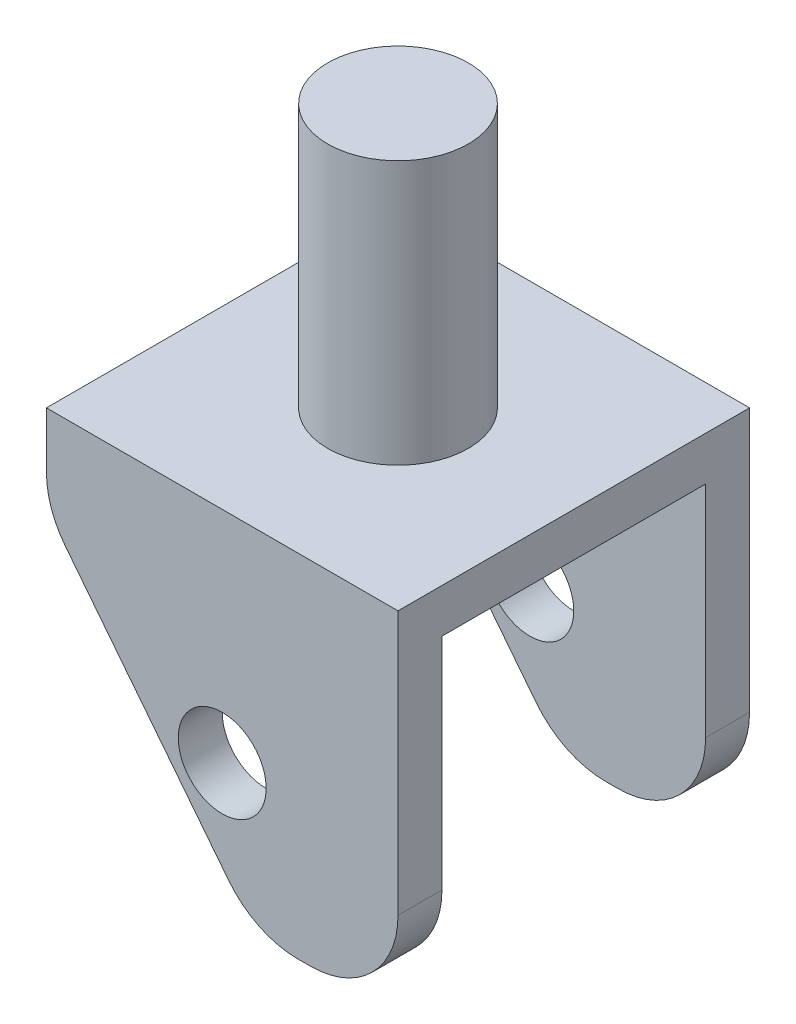
ISO-10303-21;
HEADER;
FILE_DESCRIPTION(('STEP AP214'),'2;1');
FILE_NAME('part.step','',(''),(''),'','','');
FILE_SCHEMA(('AUTOMOTIVE_DESIGN { 1 0 10303 214 1 1 1 1 }'));
ENDSEC;
DATA;
#1=APPLICATION_CONTEXT('core data for automotive mechanical design processes');
#2=APPLICATION_PROTOCOL_DEFINITION('international standard','automotive_design',2000,#1);
#3=PRODUCT_CONTEXT('',#1,'mechanical');
#4=PRODUCT('Part','Part','',(#3));
#5=PRODUCT_RELATED_PRODUCT_CATEGORY('part','',(#4));
#6=PRODUCT_DEFINITION_FORMATION('','',#4);
#7=PRODUCT_DEFINITION_CONTEXT('part definition',#1,'design');
#8=PRODUCT_DEFINITION('design','',#6,#7);
#9=PRODUCT_DEFINITION_SHAPE('','',#8);
#10=(LENGTH_UNIT() NAMED_UNIT(*) SI_UNIT(.MILLI.,.METRE.));
#11=(NAMED_UNIT(*) PLANE_ANGLE_UNIT() SI_UNIT($,.RADIAN.));
#12=(NAMED_UNIT(*) SI_UNIT($,.STERADIAN.) SOLID_ANGLE_UNIT());
#13=UNCERTAINTY_MEASURE_WITH_UNIT(LENGTH_MEASURE(1.E-05),#10,'distance_accuracy_value','');
#14=(GEOMETRIC_REPRESENTATION_CONTEXT(3) GLOBAL_UNCERTAINTY_ASSIGNED_CONTEXT((#13)) GLOBAL_UNIT_ASSIGNED_CONTEXT((#10,
#11,#12)) REPRESENTATION_CONTEXT('',''));
#15=CARTESIAN_POINT('',(0.,0.,0.));
#16=DIRECTION('',(0.,0.,1.));
#17=DIRECTION('',(1.,0.,0.));
#18=AXIS2_PLACEMENT_3D('',#15,#16,#17);
#19=CARTESIAN_POINT('',(-8.99022801302931,13.1058889009629,40.));
#20=DIRECTION('',(0.786278855083332,0.617871800658393,0.));
#21=DIRECTION('',(-0.617871800658393,0.786278855083332,0.));
#22=AXIS2_PLACEMENT_3D('',#19,#20,#21);
#23=PLANE('',#22);
#24=DIRECTION('',(0.617871800658393,-0.786278855083332,0.));
#25=VECTOR('',#24,1.);
#26=CARTESIAN_POINT('',(-8.99022801302931,13.1058889009629,40.));
#27=LINE('',#26,#25);
#28=CARTESIAN_POINT('',(-6.85301656386263,10.3861593882531,40.));
#29=VERTEX_POINT('',#28);
#30=CARTESIAN_POINT('',(11.729764492103,-13.2615419591451,40.));
#31=VERTEX_POINT('',#30);
#32=EDGE_CURVE('E216',#29,#31,#27,.T.);
#33=ORIENTED_EDGE('',*,*,#32,.F.);
#34=DIRECTION('',(0.,0.,-1.));
#35=VECTOR('',#34,1.);
#36=CARTESIAN_POINT('',(-6.85301656386263,10.3861593882531,40.));
#37=LINE('',#36,#35);
#38=CARTESIAN_POINT('',(-6.85301656386263,10.3861593882531,35.));
#39=VERTEX_POINT('',#38);
#40=EDGE_CURVE('E320',#29,#39,#37,.T.);
#41=ORIENTED_EDGE('',*,*,#40,.T.);
#42=DIRECTION('',(0.617871800658393,-0.786278855083332,0.));
#43=VECTOR('',#42,1.);
#44=CARTESIAN_POINT('',(-8.99022801302931,13.1058889009629,35.));
#45=LINE('',#44,#43);
#46=CARTESIAN_POINT('',(11.729764492103,-13.2615419591451,35.));
#47=VERTEX_POINT('',#46);
#48=EDGE_CURVE('E207',#39,#47,#45,.T.);
#49=ORIENTED_EDGE('',*,*,#48,.T.);
#50=DIRECTION('',(0.,0.,-1.));
#51=VECTOR('',#50,1.);
#52=CARTESIAN_POINT('',(11.729764492103,-13.2615419591451,40.));
#53=LINE('',#52,#51);
#54=EDGE_CURVE('E317',#47,#31,#53,.F.);
#55=ORIENTED_EDGE('',*,*,#54,.T.);
#56=EDGE_LOOP('',(#33,#41,#49,#55));
#57=FACE_BOUND('',#56,.T.);
#58=ADVANCED_FACE('F38',(#57),#23,.F.);
#59=CARTESIAN_POINT('',(14.7325953209255,-17.0828239525612,40.));
#60=DIRECTION('',(0.,1.,0.));
#61=DIRECTION('',(0.,0.,1.));
#62=AXIS2_PLACEMENT_3D('',#59,#60,#61);
#63=PLANE('',#62);
#64=DIRECTION('',(1.,0.,0.));
#65=VECTOR('',#64,1.);
#66=CARTESIAN_POINT('',(-8.99022801302931,-17.0828239525612,35.));
#67=LINE('',#66,#65);
#68=CARTESIAN_POINT('',(19.5925530429363,-17.0828239525612,35.));
#69=VERTEX_POINT('',#68);
#70=CARTESIAN_POINT('',(21.0097719869707,-17.0828239525612,35.));
#71=VERTEX_POINT('',#70);
#72=EDGE_CURVE('E182',#69,#71,#67,.T.);
#73=ORIENTED_EDGE('',*,*,#72,.T.);
#74=DIRECTION('',(0.,0.,-1.));
#75=VECTOR('',#74,1.);
#76=CARTESIAN_POINT('',(21.0097719869707,-17.0828239525612,40.));
#77=LINE('',#76,#75);
#78=CARTESIAN_POINT('',(21.0097719869707,-17.0828239525612,40.));
#79=VERTEX_POINT('',#78);
#80=EDGE_CURVE('E281',#71,#79,#77,.F.);
#81=ORIENTED_EDGE('',*,*,#80,.T.);
#82=DIRECTION('',(1.,0.,0.));
#83=VECTOR('',#82,1.);
#84=CARTESIAN_POINT('',(14.7325953209255,-17.0828239525612,40.));
#85=LINE('',#84,#83);
#86=CARTESIAN_POINT('',(19.5925530429363,-17.0828239525612,40.));
#87=VERTEX_POINT('',#86);
#88=EDGE_CURVE('E221',#87,#79,#85,.T.);
#89=ORIENTED_EDGE('',*,*,#88,.F.);
#90=DIRECTION('',(0.,0.,-1.));
#91=VECTOR('',#90,1.);
#92=CARTESIAN_POINT('',(19.5925530429363,-17.0828239525612,40.));
#93=LINE('',#92,#91);
#94=EDGE_CURVE('E277',#87,#69,#93,.T.);
#95=ORIENTED_EDGE('',*,*,#94,.T.);
#96=EDGE_LOOP('',(#73,#81,#89,#95));
#97=FACE_BOUND('',#96,.T.);
#98=ADVANCED_FACE('F413',(#97),#63,.F.);
#99=CARTESIAN_POINT('',(-8.99022801302931,22.9171760474388,40.));
#100=DIRECTION('',(1.,0.,0.));
#101=DIRECTION('',(0.,1.,0.));
#102=AXIS2_PLACEMENT_3D('',#99,#100,#101);
#103=PLANE('',#102);
#104=DIRECTION('',(0.,-1.,0.));
#105=VECTOR('',#104,1.);
#106=CARTESIAN_POINT('',(-8.99022801302931,-17.0828239525612,35.));
#107=LINE('',#106,#105);
#108=CARTESIAN_POINT('',(-8.99022801302931,17.9171760474388,35.));
#109=VERTEX_POINT('',#108);
#110=CARTESIAN_POINT('',(-8.99022801302931,16.564877394837,35.));
#111=VERTEX_POINT('',#110);
#112=EDGE_CURVE('E164',#109,#111,#107,.T.);
#113=ORIENTED_EDGE('',*,*,#112,.T.);
#114=DIRECTION('',(0.,0.,-1.));
#115=VECTOR('',#114,1.);
#116=CARTESIAN_POINT('',(-8.99022801302931,16.564877394837,40.));
#117=LINE('',#116,#115);
#118=CARTESIAN_POINT('',(-8.99022801302931,16.564877394837,40.));
#119=VERTEX_POINT('',#118);
#120=EDGE_CURVE('E326',#111,#119,#117,.F.);
#121=ORIENTED_EDGE('',*,*,#120,.T.);
#122=DIRECTION('',(0.,-1.,0.));
#123=VECTOR('',#122,1.);
#124=CARTESIAN_POINT('',(-8.99022801302931,22.9171760474388,40.));
#125=LINE('',#124,#123);
#126=CARTESIAN_POINT('',(-8.99022801302931,22.9171760474388,40.));
#127=VERTEX_POINT('',#126);
#128=EDGE_CURVE('E212',#127,#119,#125,.T.);
#129=ORIENTED_EDGE('',*,*,#128,.F.);
#130=DIRECTION('',(0.,0.,-1.));
#131=VECTOR('',#130,1.);
#132=CARTESIAN_POINT('',(-8.99022801302931,22.9171760474388,40.));
#133=LINE('',#132,#131);
#134=CARTESIAN_POINT('',(-8.99022801302931,22.9171760474388,0.));
#135=VERTEX_POINT('',#134);
#136=EDGE_CURVE('E233',#127,#135,#133,.T.);
#137=ORIENTED_EDGE('',*,*,#136,.T.);
#138=DIRECTION('',(0.,-1.,0.));
#139=VECTOR('',#138,1.);
#140=CARTESIAN_POINT('',(-8.99022801302931,22.9171760474388,0.));
#141=LINE('',#140,#139);
#142=CARTESIAN_POINT('',(-8.99022801302931,16.564877394837,0.));
#143=VERTEX_POINT('',#142);
#144=EDGE_CURVE('E211',#135,#143,#141,.T.);
#145=ORIENTED_EDGE('',*,*,#144,.T.);
#146=DIRECTION('',(0.,0.,-1.));
#147=VECTOR('',#146,1.);
#148=CARTESIAN_POINT('',(-8.99022801302931,16.564877394837,40.));
#149=LINE('',#148,#147);
#150=CARTESIAN_POINT('',(-8.99022801302931,16.564877394837,5.));
#151=VERTEX_POINT('',#150);
#152=EDGE_CURVE('E162',#143,#151,#149,.F.);
#153=ORIENTED_EDGE('',*,*,#152,.T.);
#154=DIRECTION('',(0.,1.,0.));
#155=VECTOR('',#154,1.);
#156=CARTESIAN_POINT('',(-8.99022801302931,-17.0828239525612,5.));
#157=LINE('',#156,#155);
#158=CARTESIAN_POINT('',(-8.99022801302931,17.9171760474388,5.));
#159=VERTEX_POINT('',#158);
#160=EDGE_CURVE('E154',#151,#159,#157,.T.);
#161=ORIENTED_EDGE('',*,*,#160,.T.);
#162=DIRECTION('',(0.,0.,1.));
#163=VECTOR('',#162,1.);
#164=CARTESIAN_POINT('',(-8.99022801302931,17.9171760474388,35.));
#165=LINE('',#164,#163);
#166=EDGE_CURVE('E159',#159,#109,#165,.T.);
#167=ORIENTED_EDGE('',*,*,#166,.T.);
#168=EDGE_LOOP('',(#113,#121,#129,#137,#145,#153,#161,#167));
#169=FACE_BOUND('',#168,.T.);
#170=ADVANCED_FACE('F157',(#169),#103,.F.);
#171=DIRECTION('',(-0.617871800658393,0.786278855083332,0.));
#172=VECTOR('',#171,1.);
#173=CARTESIAN_POINT('',(-8.99022801302931,13.1058889009629,5.));
#174=LINE('',#173,#172);
#175=CARTESIAN_POINT('',(11.729764492103,-13.2615419591451,5.));
#176=VERTEX_POINT('',#175);
#177=CARTESIAN_POINT('',(-6.85301656386263,10.3861593882531,5.));
#178=VERTEX_POINT('',#177);
#179=EDGE_CURVE('E201',#176,#178,#174,.T.);
#180=ORIENTED_EDGE('',*,*,#179,.T.);
#181=DIRECTION('',(0.,0.,-1.));
#182=VECTOR('',#181,1.);
#183=CARTESIAN_POINT('',(-6.85301656386263,10.3861593882531,40.));
#184=LINE('',#183,#182);
#185=CARTESIAN_POINT('',(-6.85301656386263,10.3861593882531,0.));
#186=VERTEX_POINT('',#185);
#187=EDGE_CURVE('E42',#178,#186,#184,.T.);
#188=ORIENTED_EDGE('',*,*,#187,.T.);
#189=DIRECTION('',(0.617871800658393,-0.786278855083332,0.));
#190=VECTOR('',#189,1.);
#191=CARTESIAN_POINT('',(-8.99022801302931,13.1058889009629,0.));
#192=LINE('',#191,#190);
#193=CARTESIAN_POINT('',(11.729764492103,-13.2615419591451,0.));
#194=VERTEX_POINT('',#193);
#195=EDGE_CURVE('E236',#186,#194,#192,.T.);
#196=ORIENTED_EDGE('',*,*,#195,.T.);
#197=DIRECTION('',(0.,0.,-1.));
#198=VECTOR('',#197,1.);
#199=CARTESIAN_POINT('',(11.729764492103,-13.2615419591451,40.));
#200=LINE('',#199,#198);
#201=EDGE_CURVE('E62',#194,#176,#200,.F.);
#202=ORIENTED_EDGE('',*,*,#201,.T.);
#203=EDGE_LOOP('',(#180,#188,#196,#202));
#204=FACE_BOUND('',#203,.T.);
#205=ADVANCED_FACE('F335',(#204),#23,.F.);
#206=DIRECTION('',(1.,0.,0.));
#207=VECTOR('',#206,1.);
#208=CARTESIAN_POINT('',(14.7325953209255,-17.0828239525612,0.));
#209=LINE('',#208,#207);
#210=CARTESIAN_POINT('',(19.5925530429363,-17.0828239525612,0.));
#211=VERTEX_POINT('',#210);
#212=CARTESIAN_POINT('',(21.0097719869707,-17.0828239525612,0.));
#213=VERTEX_POINT('',#212);
#214=EDGE_CURVE('E239',#211,#213,#209,.T.);
#215=ORIENTED_EDGE('',*,*,#214,.T.);
#216=DIRECTION('',(0.,0.,-1.));
#217=VECTOR('',#216,1.);
#218=CARTESIAN_POINT('',(21.0097719869707,-17.0828239525612,5.));
#219=LINE('',#218,#217);
#220=CARTESIAN_POINT('',(21.0097719869707,-17.0828239525612,5.));
#221=VERTEX_POINT('',#220);
#222=EDGE_CURVE('E306',#213,#221,#219,.F.);
#223=ORIENTED_EDGE('',*,*,#222,.T.);
#224=DIRECTION('',(1.,0.,0.));
#225=VECTOR('',#224,1.);
#226=CARTESIAN_POINT('',(-8.99022801302931,-17.0828239525612,5.));
#227=LINE('',#226,#225);
#228=CARTESIAN_POINT('',(19.5925530429363,-17.0828239525612,5.));
#229=VERTEX_POINT('',#228);
#230=EDGE_CURVE('E177',#229,#221,#227,.T.);
#231=ORIENTED_EDGE('',*,*,#230,.F.);
#232=DIRECTION('',(0.,0.,-1.));
#233=VECTOR('',#232,1.);
#234=CARTESIAN_POINT('',(19.5925530429363,-17.0828239525612,40.));
#235=LINE('',#234,#233);
#236=EDGE_CURVE('E302',#229,#211,#235,.T.);
#237=ORIENTED_EDGE('',*,*,#236,.T.);
#238=EDGE_LOOP('',(#215,#223,#231,#237));
#239=FACE_BOUND('',#238,.T.);
#240=ADVANCED_FACE('F346',(#239),#63,.F.);
#241=CARTESIAN_POINT('',(31.0097719869707,22.9171760474388,40.));
#242=DIRECTION('',(1.,0.,0.));
#243=DIRECTION('',(0.,0.,-1.));
#244=AXIS2_PLACEMENT_3D('',#241,#242,#243);
#245=PLANE('',#244);
#246=DIRECTION('',(0.,-1.,0.));
#247=VECTOR('',#246,1.);
#248=CARTESIAN_POINT('',(31.0097719869707,22.9171760474388,40.));
#249=LINE('',#248,#247);
#250=CARTESIAN_POINT('',(31.0097719869707,22.9171760474388,40.));
#251=VERTEX_POINT('',#250);
#252=CARTESIAN_POINT('',(31.0097719869707,-7.08282395256118,40.));
#253=VERTEX_POINT('',#252);
#254=EDGE_CURVE('E225',#251,#253,#249,.T.);
#255=ORIENTED_EDGE('',*,*,#254,.T.);
#256=DIRECTION('',(0.,0.,-1.));
#257=VECTOR('',#256,1.);
#258=CARTESIAN_POINT('',(31.0097719869707,-7.08282395256118,35.));
#259=LINE('',#258,#257);
#260=CARTESIAN_POINT('',(31.0097719869707,-7.08282395256118,35.));
#261=VERTEX_POINT('',#260);
#262=EDGE_CURVE('E264',#253,#261,#259,.T.);
#263=ORIENTED_EDGE('',*,*,#262,.T.);
#264=DIRECTION('',(0.,-1.,0.));
#265=VECTOR('',#264,1.);
#266=CARTESIAN_POINT('',(31.0097719869707,-17.0828239525612,35.));
#267=LINE('',#266,#265);
#268=CARTESIAN_POINT('',(31.0097719869707,17.9171760474388,35.));
#269=VERTEX_POINT('',#268);
#270=EDGE_CURVE('E190',#269,#261,#267,.T.);
#271=ORIENTED_EDGE('',*,*,#270,.F.);
#272=DIRECTION('',(0.,0.,1.));
#273=VECTOR('',#272,1.);
#274=CARTESIAN_POINT('',(31.0097719869707,17.9171760474388,35.));
#275=LINE('',#274,#273);
#276=CARTESIAN_POINT('',(31.0097719869707,17.9171760474388,5.));
#277=VERTEX_POINT('',#276);
#278=EDGE_CURVE('E197',#277,#269,#275,.T.);
#279=ORIENTED_EDGE('',*,*,#278,.F.);
#280=DIRECTION('',(0.,1.,0.));
#281=VECTOR('',#280,1.);
#282=CARTESIAN_POINT('',(31.0097719869707,-17.0828239525612,5.));
#283=LINE('',#282,#281);
#284=CARTESIAN_POINT('',(31.0097719869707,-7.08282395256118,5.));
#285=VERTEX_POINT('',#284);
#286=EDGE_CURVE('E171',#285,#277,#283,.T.);
#287=ORIENTED_EDGE('',*,*,#286,.F.);
#288=DIRECTION('',(0.,0.,-1.));
#289=VECTOR('',#288,1.);
#290=CARTESIAN_POINT('',(31.0097719869707,-7.08282395256118,0.));
#291=LINE('',#290,#289);
#292=CARTESIAN_POINT('',(31.0097719869707,-7.08282395256118,0.));
#293=VERTEX_POINT('',#292);
#294=EDGE_CURVE('E255',#285,#293,#291,.T.);
#295=ORIENTED_EDGE('',*,*,#294,.T.);
#296=DIRECTION('',(0.,-1.,0.));
#297=VECTOR('',#296,1.);
#298=CARTESIAN_POINT('',(31.0097719869707,22.9171760474388,0.));
#299=LINE('',#298,#297);
#300=CARTESIAN_POINT('',(31.0097719869707,22.9171760474388,0.));
#301=VERTEX_POINT('',#300);
#302=EDGE_CURVE('E243',#301,#293,#299,.T.);
#303=ORIENTED_EDGE('',*,*,#302,.F.);
#304=DIRECTION('',(0.,0.,-1.));
#305=VECTOR('',#304,1.);
#306=CARTESIAN_POINT('',(31.0097719869707,22.9171760474388,40.));
#307=LINE('',#306,#305);
#308=EDGE_CURVE('E252',#251,#301,#307,.T.);
#309=ORIENTED_EDGE('',*,*,#308,.F.);
#310=EDGE_LOOP('',(#255,#263,#271,#279,#287,#295,#303,#309));
#311=FACE_BOUND('',#310,.T.);
#312=ADVANCED_FACE('F354',(#311),#245,.T.);
#313=CARTESIAN_POINT('',(-8.99022801302931,22.9171760474388,40.));
#314=DIRECTION('',(0.,1.,0.));
#315=DIRECTION('',(0.,0.,1.));
#316=AXIS2_PLACEMENT_3D('',#313,#314,#315);
#317=PLANE('',#316);
#318=CARTESIAN_POINT('',(11.0097719869707,22.9171760474388,20.));
#319=DIRECTION('',(0.,1.,0.));
#320=DIRECTION('',(0.,0.,1.));
#321=AXIS2_PLACEMENT_3D('',#318,#319,#320);
#322=CIRCLE('',#321,8.);
#323=CARTESIAN_POINT('',(11.0097719869707,22.9171760474388,28.));
#324=VERTEX_POINT('',#323);
#325=EDGE_CURVE('E11',#324,#324,#322,.T.);
#326=ORIENTED_EDGE('',*,*,#325,.F.);
#327=EDGE_LOOP('',(#326));
#328=FACE_BOUND('',#327,.T.);
#329=DIRECTION('',(1.,0.,0.));
#330=VECTOR('',#329,1.);
#331=CARTESIAN_POINT('',(-8.99022801302931,22.9171760474388,0.));
#332=LINE('',#331,#330);
#333=EDGE_CURVE('E217',#135,#301,#332,.T.);
#334=ORIENTED_EDGE('',*,*,#333,.F.);
#335=ORIENTED_EDGE('',*,*,#136,.F.);
#336=DIRECTION('',(1.,0.,0.));
#337=VECTOR('',#336,1.);
#338=CARTESIAN_POINT('',(-8.99022801302931,22.9171760474388,40.));
#339=LINE('',#338,#337);
#340=EDGE_CURVE('E229',#127,#251,#339,.T.);
#341=ORIENTED_EDGE('',*,*,#340,.T.);
#342=ORIENTED_EDGE('',*,*,#308,.T.);
#343=EDGE_LOOP('',(#334,#335,#341,#342));
#344=FACE_BOUND('',#343,.T.);
#345=ADVANCED_FACE('F357',(#328,#344),#317,.T.);
#346=CARTESIAN_POINT('',(0.,0.,40.));
#347=DIRECTION('',(0.,0.,1.));
#348=DIRECTION('',(1.,0.,0.));
#349=AXIS2_PLACEMENT_3D('',#346,#347,#348);
#350=PLANE('',#349);
#351=CARTESIAN_POINT('',(11.0097719869707,-2.08282395256119,40.));
#352=DIRECTION('',(0.,0.,-1.));
#353=DIRECTION('',(-1.,0.,0.));
#354=AXIS2_PLACEMENT_3D('',#351,#352,#353);
#355=CIRCLE('',#354,5.);
#356=CARTESIAN_POINT('',(6.00977198697069,-2.08282395256119,40.));
#357=VERTEX_POINT('',#356);
#358=EDGE_CURVE('E260',#357,#357,#355,.T.);
#359=ORIENTED_EDGE('',*,*,#358,.T.);
#360=EDGE_LOOP('',(#359));
#361=FACE_BOUND('',#360,.T.);
#362=ORIENTED_EDGE('',*,*,#88,.T.);
#363=CARTESIAN_POINT('',(21.0097719869707,-7.08282395256118,40.));
#364=DIRECTION('',(0.,0.,1.));
#365=DIRECTION('',(1.,0.,0.));
#366=AXIS2_PLACEMENT_3D('',#363,#364,#365);
#367=CIRCLE('',#366,10.);
#368=EDGE_CURVE('E290',#79,#253,#367,.T.);
#369=ORIENTED_EDGE('',*,*,#368,.T.);
#370=ORIENTED_EDGE('',*,*,#254,.F.);
#371=ORIENTED_EDGE('',*,*,#340,.F.);
#372=ORIENTED_EDGE('',*,*,#128,.T.);
#373=CARTESIAN_POINT('',(1.00977198697069,16.564877394837,40.));
#374=DIRECTION('',(0.,0.,1.));
#375=DIRECTION('',(1.,0.,0.));
#376=AXIS2_PLACEMENT_3D('',#373,#374,#375);
#377=CIRCLE('',#376,10.);
#378=EDGE_CURVE('E287',#119,#29,#377,.T.);
#379=ORIENTED_EDGE('',*,*,#378,.T.);
#380=ORIENTED_EDGE('',*,*,#32,.T.);
#381=CARTESIAN_POINT('',(19.5925530429363,-7.08282395256119,40.));
#382=DIRECTION('',(0.,0.,1.));
#383=DIRECTION('',(1.,0.,0.));
#384=AXIS2_PLACEMENT_3D('',#381,#382,#383);
#385=CIRCLE('',#384,10.);
#386=EDGE_CURVE('E284',#31,#87,#385,.T.);
#387=ORIENTED_EDGE('',*,*,#386,.T.);
#388=EDGE_LOOP('',(#362,#369,#370,#371,#372,#379,#380,#387));
#389=FACE_BOUND('',#388,.T.);
#390=ADVANCED_FACE('F363',(#361,#389),#350,.T.);
#391=CARTESIAN_POINT('',(0.,0.,0.));
#392=DIRECTION('',(0.,0.,1.));
#393=DIRECTION('',(1.,0.,0.));
#394=AXIS2_PLACEMENT_3D('',#391,#392,#393);
#395=PLANE('',#394);
#396=CARTESIAN_POINT('',(11.0097719869707,-2.08282395256119,0.));
#397=DIRECTION('',(0.,0.,-1.));
#398=DIRECTION('',(-1.,0.,0.));
#399=AXIS2_PLACEMENT_3D('',#396,#397,#398);
#400=CIRCLE('',#399,5.);
#401=CARTESIAN_POINT('',(6.00977198697069,-2.08282395256119,0.));
#402=VERTEX_POINT('',#401);
#403=EDGE_CURVE('E381',#402,#402,#400,.T.);
#404=ORIENTED_EDGE('',*,*,#403,.F.);
#405=EDGE_LOOP('',(#404));
#406=FACE_BOUND('',#405,.T.);
#407=ORIENTED_EDGE('',*,*,#302,.T.);
#408=CARTESIAN_POINT('',(21.0097719869707,-7.08282395256118,0.));
#409=DIRECTION('',(0.,0.,1.));
#410=DIRECTION('',(1.,0.,0.));
#411=AXIS2_PLACEMENT_3D('',#408,#409,#410);
#412=CIRCLE('',#411,10.);
#413=EDGE_CURVE('E299',#293,#213,#412,.F.);
#414=ORIENTED_EDGE('',*,*,#413,.T.);
#415=ORIENTED_EDGE('',*,*,#214,.F.);
#416=CARTESIAN_POINT('',(19.5925530429363,-7.08282395256119,0.));
#417=DIRECTION('',(0.,0.,1.));
#418=DIRECTION('',(1.,0.,0.));
#419=AXIS2_PLACEMENT_3D('',#416,#417,#418);
#420=CIRCLE('',#419,10.);
#421=EDGE_CURVE('E293',#211,#194,#420,.F.);
#422=ORIENTED_EDGE('',*,*,#421,.T.);
#423=ORIENTED_EDGE('',*,*,#195,.F.);
#424=CARTESIAN_POINT('',(1.00977198697069,16.564877394837,0.));
#425=DIRECTION('',(0.,0.,1.));
#426=DIRECTION('',(1.,0.,0.));
#427=AXIS2_PLACEMENT_3D('',#424,#425,#426);
#428=CIRCLE('',#427,10.);
#429=EDGE_CURVE('E296',#186,#143,#428,.F.);
#430=ORIENTED_EDGE('',*,*,#429,.T.);
#431=ORIENTED_EDGE('',*,*,#144,.F.);
#432=ORIENTED_EDGE('',*,*,#333,.T.);
#433=EDGE_LOOP('',(#407,#414,#415,#422,#423,#430,#431,#432));
#434=FACE_BOUND('',#433,.T.);
#435=ADVANCED_FACE('F338',(#406,#434),#395,.F.);
#436=CARTESIAN_POINT('',(-8.99022801302931,-17.0828239525612,35.));
#437=DIRECTION('',(0.,0.,1.));
#438=DIRECTION('',(1.,0.,0.));
#439=AXIS2_PLACEMENT_3D('',#436,#437,#438);
#440=PLANE('',#439);
#441=CARTESIAN_POINT('',(11.0097719869707,-2.08282395256119,35.));
#442=DIRECTION('',(0.,0.,1.));
#443=DIRECTION('',(1.,0.,0.));
#444=AXIS2_PLACEMENT_3D('',#441,#442,#443);
#445=CIRCLE('',#444,5.);
#446=CARTESIAN_POINT('',(16.0097719869707,-2.08282395256119,35.));
#447=VERTEX_POINT('',#446);
#448=EDGE_CURVE('E194',#447,#447,#445,.T.);
#449=ORIENTED_EDGE('',*,*,#448,.T.);
#450=EDGE_LOOP('',(#449));
#451=FACE_BOUND('',#450,.T.);
#452=ORIENTED_EDGE('',*,*,#270,.T.);
#453=CARTESIAN_POINT('',(21.0097719869707,-7.08282395256118,35.));
#454=DIRECTION('',(0.,0.,1.));
#455=DIRECTION('',(1.,0.,0.));
#456=AXIS2_PLACEMENT_3D('',#453,#454,#455);
#457=CIRCLE('',#456,10.);
#458=EDGE_CURVE('E274',#261,#71,#457,.F.);
#459=ORIENTED_EDGE('',*,*,#458,.T.);
#460=ORIENTED_EDGE('',*,*,#72,.F.);
#461=CARTESIAN_POINT('',(19.5925530429363,-7.08282395256119,35.));
#462=DIRECTION('',(0.,0.,1.));
#463=DIRECTION('',(1.,0.,0.));
#464=AXIS2_PLACEMENT_3D('',#461,#462,#463);
#465=CIRCLE('',#464,10.);
#466=EDGE_CURVE('E268',#69,#47,#465,.F.);
#467=ORIENTED_EDGE('',*,*,#466,.T.);
#468=ORIENTED_EDGE('',*,*,#48,.F.);
#469=CARTESIAN_POINT('',(1.00977198697069,16.564877394837,35.));
#470=DIRECTION('',(0.,0.,1.));
#471=DIRECTION('',(1.,0.,0.));
#472=AXIS2_PLACEMENT_3D('',#469,#470,#471);
#473=CIRCLE('',#472,10.);
#474=EDGE_CURVE('E271',#39,#111,#473,.F.);
#475=ORIENTED_EDGE('',*,*,#474,.T.);
#476=ORIENTED_EDGE('',*,*,#112,.F.);
#477=DIRECTION('',(1.,0.,0.));
#478=VECTOR('',#477,1.);
#479=CARTESIAN_POINT('',(-8.99022801302931,17.9171760474388,35.));
#480=LINE('',#479,#478);
#481=EDGE_CURVE('E176',#109,#269,#480,.T.);
#482=ORIENTED_EDGE('',*,*,#481,.T.);
#483=EDGE_LOOP('',(#452,#459,#460,#467,#468,#475,#476,#482));
#484=FACE_BOUND('',#483,.T.);
#485=ADVANCED_FACE('F371',(#451,#484),#440,.F.);
#486=CARTESIAN_POINT('',(-8.99022801302931,-17.0828239525612,5.));
#487=DIRECTION('',(0.,0.,-1.));
#488=DIRECTION('',(-1.,0.,0.));
#489=AXIS2_PLACEMENT_3D('',#486,#487,#488);
#490=PLANE('',#489);
#491=CARTESIAN_POINT('',(11.0097719869707,-2.08282395256119,5.));
#492=DIRECTION('',(0.,0.,-1.));
#493=DIRECTION('',(-1.,0.,0.));
#494=AXIS2_PLACEMENT_3D('',#491,#492,#493);
#495=CIRCLE('',#494,5.);
#496=CARTESIAN_POINT('',(6.00977198697069,-2.08282395256119,5.));
#497=VERTEX_POINT('',#496);
#498=EDGE_CURVE('E256',#497,#497,#495,.T.);
#499=ORIENTED_EDGE('',*,*,#498,.T.);
#500=EDGE_LOOP('',(#499));
#501=FACE_BOUND('',#500,.T.);
#502=ORIENTED_EDGE('',*,*,#230,.T.);
#503=CARTESIAN_POINT('',(21.0097719869707,-7.08282395256118,5.));
#504=DIRECTION('',(0.,0.,-1.));
#505=DIRECTION('',(-1.,0.,0.));
#506=AXIS2_PLACEMENT_3D('',#503,#504,#505);
#507=CIRCLE('',#506,10.);
#508=EDGE_CURVE('E314',#221,#285,#507,.F.);
#509=ORIENTED_EDGE('',*,*,#508,.T.);
#510=ORIENTED_EDGE('',*,*,#286,.T.);
#511=DIRECTION('',(1.,0.,0.));
#512=VECTOR('',#511,1.);
#513=CARTESIAN_POINT('',(-8.99022801302931,17.9171760474388,5.));
#514=LINE('',#513,#512);
#515=EDGE_CURVE('E167',#159,#277,#514,.T.);
#516=ORIENTED_EDGE('',*,*,#515,.F.);
#517=ORIENTED_EDGE('',*,*,#160,.F.);
#518=CARTESIAN_POINT('',(1.00977198697069,16.564877394837,5.));
#519=DIRECTION('',(0.,0.,-1.));
#520=DIRECTION('',(-1.,0.,0.));
#521=AXIS2_PLACEMENT_3D('',#518,#519,#520);
#522=CIRCLE('',#521,10.);
#523=EDGE_CURVE('E55',#151,#178,#522,.F.);
#524=ORIENTED_EDGE('',*,*,#523,.T.);
#525=ORIENTED_EDGE('',*,*,#179,.F.);
#526=CARTESIAN_POINT('',(19.5925530429363,-7.08282395256119,5.));
#527=DIRECTION('',(0.,0.,-1.));
#528=DIRECTION('',(-1.,0.,0.));
#529=AXIS2_PLACEMENT_3D('',#526,#527,#528);
#530=CIRCLE('',#529,10.);
#531=EDGE_CURVE('E309',#176,#229,#530,.F.);
#532=ORIENTED_EDGE('',*,*,#531,.T.);
#533=EDGE_LOOP('',(#502,#509,#510,#516,#517,#524,#525,#532));
#534=FACE_BOUND('',#533,.T.);
#535=ADVANCED_FACE('F169',(#501,#534),#490,.F.);
#536=CARTESIAN_POINT('',(-8.99022801302931,17.9171760474388,35.));
#537=DIRECTION('',(0.,1.,0.));
#538=DIRECTION('',(0.,0.,1.));
#539=AXIS2_PLACEMENT_3D('',#536,#537,#538);
#540=PLANE('',#539);
#541=ORIENTED_EDGE('',*,*,#278,.T.);
#542=ORIENTED_EDGE('',*,*,#481,.F.);
#543=ORIENTED_EDGE('',*,*,#166,.F.);
#544=ORIENTED_EDGE('',*,*,#515,.T.);
#545=EDGE_LOOP('',(#541,#542,#543,#544));
#546=FACE_BOUND('',#545,.T.);
#547=ADVANCED_FACE('F179',(#546),#540,.F.);
#548=CARTESIAN_POINT('',(11.0097719869707,-2.08282395256119,40.));
#549=DIRECTION('',(0.,0.,-1.));
#550=DIRECTION('',(-1.,0.,0.));
#551=AXIS2_PLACEMENT_3D('',#548,#549,#550);
#552=CYLINDRICAL_SURFACE('',#551,5.);
#553=ORIENTED_EDGE('',*,*,#403,.T.);
#554=EDGE_LOOP('',(#553));
#555=FACE_BOUND('',#554,.T.);
#556=ORIENTED_EDGE('',*,*,#498,.F.);
#557=EDGE_LOOP('',(#556));
#558=FACE_BOUND('',#557,.T.);
#559=ADVANCED_FACE('F602',(#555,#558),#552,.F.);
#560=ORIENTED_EDGE('',*,*,#358,.F.);
#561=EDGE_LOOP('',(#560));
#562=FACE_BOUND('',#561,.T.);
#563=ORIENTED_EDGE('',*,*,#448,.F.);
#564=EDGE_LOOP('',(#563));
#565=FACE_BOUND('',#564,.T.);
#566=ADVANCED_FACE('F433',(#562,#565),#552,.F.);
#567=CARTESIAN_POINT('',(21.0097719869707,-7.08282395256118,40.));
#568=DIRECTION('',(0.,0.,1.));
#569=DIRECTION('',(1.,0.,0.));
#570=AXIS2_PLACEMENT_3D('',#567,#568,#569);
#571=CYLINDRICAL_SURFACE('',#570,10.);
#572=ORIENTED_EDGE('',*,*,#368,.F.);
#573=ORIENTED_EDGE('',*,*,#80,.F.);
#574=ORIENTED_EDGE('',*,*,#458,.F.);
#575=ORIENTED_EDGE('',*,*,#262,.F.);
#576=EDGE_LOOP('',(#572,#573,#574,#575));
#577=FACE_BOUND('',#576,.T.);
#578=ADVANCED_FACE('F368',(#577),#571,.T.);
#579=CARTESIAN_POINT('',(21.0097719869707,-7.08282395256118,40.));
#580=DIRECTION('',(0.,0.,1.));
#581=DIRECTION('',(1.,0.,0.));
#582=AXIS2_PLACEMENT_3D('',#579,#580,#581);
#583=CYLINDRICAL_SURFACE('',#582,10.);
#584=ORIENTED_EDGE('',*,*,#508,.F.);
#585=ORIENTED_EDGE('',*,*,#222,.F.);
#586=ORIENTED_EDGE('',*,*,#413,.F.);
#587=ORIENTED_EDGE('',*,*,#294,.F.);
#588=EDGE_LOOP('',(#584,#585,#586,#587));
#589=FACE_BOUND('',#588,.T.);
#590=ADVANCED_FACE('F351',(#589),#583,.T.);
#591=CARTESIAN_POINT('',(1.00977198697069,16.564877394837,40.));
#592=DIRECTION('',(0.,0.,-1.));
#593=DIRECTION('',(-1.,0.,0.));
#594=AXIS2_PLACEMENT_3D('',#591,#592,#593);
#595=CYLINDRICAL_SURFACE('',#594,10.);
#596=ORIENTED_EDGE('',*,*,#378,.F.);
#597=ORIENTED_EDGE('',*,*,#120,.F.);
#598=ORIENTED_EDGE('',*,*,#474,.F.);
#599=ORIENTED_EDGE('',*,*,#40,.F.);
#600=EDGE_LOOP('',(#596,#597,#598,#599));
#601=FACE_BOUND('',#600,.T.);
#602=ADVANCED_FACE('F436',(#601),#595,.T.);
#603=CARTESIAN_POINT('',(1.00977198697069,16.564877394837,40.));
#604=DIRECTION('',(0.,0.,-1.));
#605=DIRECTION('',(-1.,0.,0.));
#606=AXIS2_PLACEMENT_3D('',#603,#604,#605);
#607=CYLINDRICAL_SURFACE('',#606,10.);
#608=ORIENTED_EDGE('',*,*,#523,.F.);
#609=ORIENTED_EDGE('',*,*,#152,.F.);
#610=ORIENTED_EDGE('',*,*,#429,.F.);
#611=ORIENTED_EDGE('',*,*,#187,.F.);
#612=EDGE_LOOP('',(#608,#609,#610,#611));
#613=FACE_BOUND('',#612,.T.);
#614=ADVANCED_FACE('F439',(#613),#607,.T.);
#615=CARTESIAN_POINT('',(19.5925530429363,-7.08282395256119,40.));
#616=DIRECTION('',(0.,0.,-1.));
#617=DIRECTION('',(-1.,0.,0.));
#618=AXIS2_PLACEMENT_3D('',#615,#616,#617);
#619=CYLINDRICAL_SURFACE('',#618,10.);
#620=ORIENTED_EDGE('',*,*,#386,.F.);
#621=ORIENTED_EDGE('',*,*,#54,.F.);
#622=ORIENTED_EDGE('',*,*,#466,.F.);
#623=ORIENTED_EDGE('',*,*,#94,.F.);
#624=EDGE_LOOP('',(#620,#621,#622,#623));
#625=FACE_BOUND('',#624,.T.);
#626=ADVANCED_FACE('F442',(#625),#619,.T.);
#627=CARTESIAN_POINT('',(19.5925530429363,-7.08282395256119,40.));
#628=DIRECTION('',(0.,0.,-1.));
#629=DIRECTION('',(-1.,0.,0.));
#630=AXIS2_PLACEMENT_3D('',#627,#628,#629);
#631=CYLINDRICAL_SURFACE('',#630,10.);
#632=ORIENTED_EDGE('',*,*,#531,.F.);
#633=ORIENTED_EDGE('',*,*,#201,.F.);
#634=ORIENTED_EDGE('',*,*,#421,.F.);
#635=ORIENTED_EDGE('',*,*,#236,.F.);
#636=EDGE_LOOP('',(#632,#633,#634,#635));
#637=FACE_BOUND('',#636,.T.);
#638=ADVANCED_FACE('F40',(#637),#631,.T.);
#639=CARTESIAN_POINT('',(11.0097719869707,52.9171760474388,20.));
#640=DIRECTION('',(0.,-1.,0.));
#641=DIRECTION('',(0.,0.,-1.));
#642=AXIS2_PLACEMENT_3D('',#639,#640,#641);
#643=CYLINDRICAL_SURFACE('',#642,8.);
#644=CARTESIAN_POINT('',(11.0097719869707,52.9171760474388,20.));
#645=DIRECTION('',(0.,1.,0.));
#646=DIRECTION('',(0.,0.,1.));
#647=AXIS2_PLACEMENT_3D('',#644,#645,#646);
#648=CIRCLE('',#647,8.);
#649=CARTESIAN_POINT('',(11.0097719869707,52.9171760474388,28.));
#650=VERTEX_POINT('',#649);
#651=EDGE_CURVE('E385',#650,#650,#648,.T.);
#652=ORIENTED_EDGE('',*,*,#651,.F.);
#653=EDGE_LOOP('',(#652));
#654=FACE_BOUND('',#653,.T.);
#655=ORIENTED_EDGE('',*,*,#325,.T.);
#656=EDGE_LOOP('',(#655));
#657=FACE_BOUND('',#656,.T.);
#658=ADVANCED_FACE('F396',(#654,#657),#643,.T.);
#659=CARTESIAN_POINT('',(11.0097719869707,52.9171760474388,20.));
#660=DIRECTION('',(0.,1.,0.));
#661=DIRECTION('',(0.,0.,1.));
#662=AXIS2_PLACEMENT_3D('',#659,#660,#661);
#663=PLANE('',#662);
#664=ORIENTED_EDGE('',*,*,#651,.T.);
#665=EDGE_LOOP('',(#664));
#666=FACE_BOUND('',#665,.T.);
#667=ADVANCED_FACE('F394',(#666),#663,.T.);
#668=CLOSED_SHELL('',(#58,#98,#170,#205,#240,#312,#345,#390,#435,#485,#535,#547,#559,#566,#578,
#590,#602,#614,#626,#638,#658,#667));
#669=MANIFOLD_SOLID_BREP('B2',#668);
#670=ADVANCED_BREP_SHAPE_REPRESENTATION('',(#18,#669),#14);
#671=SHAPE_DEFINITION_REPRESENTATION(#9,#670);
ENDSEC;
END-ISO-10303-21;
